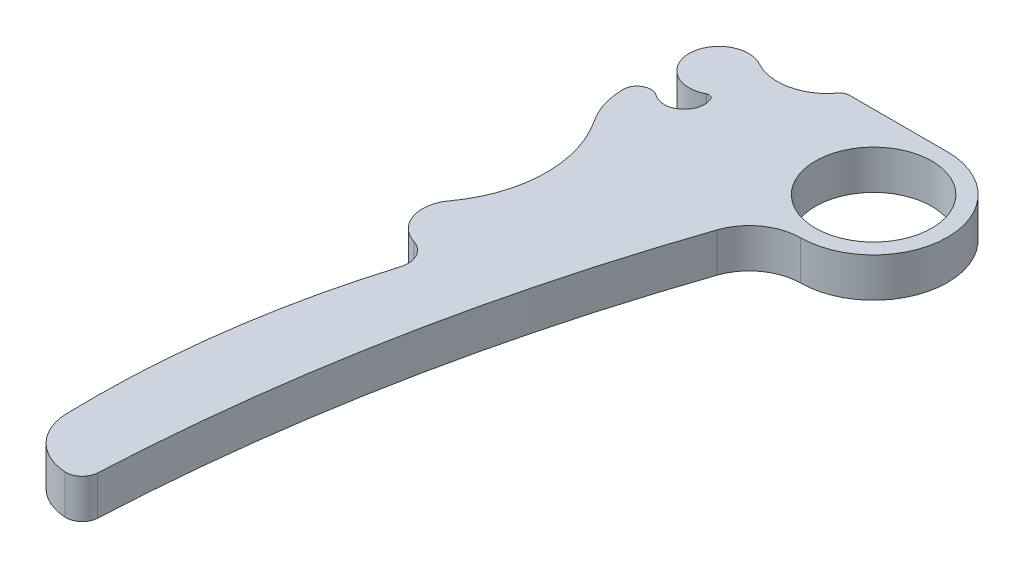
ISO-10303-21;
HEADER;
FILE_DESCRIPTION(('STEP AP214'),'2;1');
FILE_NAME('part.step','',(''),(''),'','','');
FILE_SCHEMA(('AUTOMOTIVE_DESIGN { 1 0 10303 214 1 1 1 1 }'));
ENDSEC;
DATA;
#1=APPLICATION_CONTEXT('core data for automotive mechanical design processes');
#2=APPLICATION_PROTOCOL_DEFINITION('international standard','automotive_design',2000,#1);
#3=PRODUCT_CONTEXT('',#1,'mechanical');
#4=PRODUCT('Part','Part','',(#3));
#5=PRODUCT_RELATED_PRODUCT_CATEGORY('part','',(#4));
#6=PRODUCT_DEFINITION_FORMATION('','',#4);
#7=PRODUCT_DEFINITION_CONTEXT('part definition',#1,'design');
#8=PRODUCT_DEFINITION('design','',#6,#7);
#9=PRODUCT_DEFINITION_SHAPE('','',#8);
#10=(LENGTH_UNIT() NAMED_UNIT(*) SI_UNIT(.MILLI.,.METRE.));
#11=(NAMED_UNIT(*) PLANE_ANGLE_UNIT() SI_UNIT($,.RADIAN.));
#12=(NAMED_UNIT(*) SI_UNIT($,.STERADIAN.) SOLID_ANGLE_UNIT());
#13=UNCERTAINTY_MEASURE_WITH_UNIT(LENGTH_MEASURE(1.E-05),#10,'distance_accuracy_value','');
#14=(GEOMETRIC_REPRESENTATION_CONTEXT(3) GLOBAL_UNCERTAINTY_ASSIGNED_CONTEXT((#13)) GLOBAL_UNIT_ASSIGNED_CONTEXT((#10,
#11,#12)) REPRESENTATION_CONTEXT('',''));
#15=CARTESIAN_POINT('',(0.,0.,0.));
#16=DIRECTION('',(0.,0.,1.));
#17=DIRECTION('',(1.,0.,0.));
#18=AXIS2_PLACEMENT_3D('',#15,#16,#17);
#19=CARTESIAN_POINT('',(-12.8860351239819,3.,0.0601391589932283));
#20=DIRECTION('',(0.,-1.,0.));
#21=DIRECTION('',(0.,0.,-1.));
#22=AXIS2_PLACEMENT_3D('',#19,#20,#21);
#23=CYLINDRICAL_SURFACE('',#22,0.373802251179786);
#24=CARTESIAN_POINT('',(-12.8860351239819,0.,0.0601391589932283));
#25=DIRECTION('',(0.,1.,0.));
#26=DIRECTION('',(0.,0.,1.));
#27=AXIS2_PLACEMENT_3D('',#24,#25,#26);
#28=CIRCLE('',#27,0.373802251179786);
#29=CARTESIAN_POINT('',(-12.539738196853,0.,-0.0805966262504437));
#30=VERTEX_POINT('',#29);
#31=CARTESIAN_POINT('',(-13.0589268030003,0.,-0.271276879111866));
#32=VERTEX_POINT('',#31);
#33=EDGE_CURVE('E186',#30,#32,#28,.T.);
#34=ORIENTED_EDGE('',*,*,#33,.F.);
#35=DIRECTION('',(0.,-1.,0.));
#36=VECTOR('',#35,1.);
#37=CARTESIAN_POINT('',(-12.539738196853,3.,-0.0805966262504437));
#38=LINE('',#37,#36);
#39=CARTESIAN_POINT('',(-12.539738196853,3.,-0.0805966262504437));
#40=VERTEX_POINT('',#39);
#41=EDGE_CURVE('E11',#40,#30,#38,.T.);
#42=ORIENTED_EDGE('',*,*,#41,.F.);
#43=CARTESIAN_POINT('',(-12.8860351239819,3.,0.0601391589932283));
#44=DIRECTION('',(0.,1.,0.));
#45=DIRECTION('',(0.,0.,1.));
#46=AXIS2_PLACEMENT_3D('',#43,#44,#45);
#47=CIRCLE('',#46,0.373802251179786);
#48=CARTESIAN_POINT('',(-13.0589268030003,3.,-0.271276879111866));
#49=VERTEX_POINT('',#48);
#50=EDGE_CURVE('E231',#40,#49,#47,.T.);
#51=ORIENTED_EDGE('',*,*,#50,.T.);
#52=DIRECTION('',(0.,-1.,0.));
#53=VECTOR('',#52,1.);
#54=CARTESIAN_POINT('',(-13.0589268030003,3.,-0.271276879111866));
#55=LINE('',#54,#53);
#56=EDGE_CURVE('E112',#49,#32,#55,.T.);
#57=ORIENTED_EDGE('',*,*,#56,.T.);
#58=EDGE_LOOP('',(#34,#42,#51,#57));
#59=FACE_BOUND('',#58,.T.);
#60=ADVANCED_FACE('F35',(#59),#23,.F.);
#61=CARTESIAN_POINT('',(-13.9659429335537,3.,0.499015919555077));
#62=DIRECTION('',(0.,-1.,0.));
#63=DIRECTION('',(0.,0.,-1.));
#64=AXIS2_PLACEMENT_3D('',#61,#62,#63);
#65=CYLINDRICAL_SURFACE('',#64,1.5394838921673);
#66=CARTESIAN_POINT('',(-13.9659429335537,0.,0.499015919555077));
#67=DIRECTION('',(0.,1.,0.));
#68=DIRECTION('',(0.,0.,1.));
#69=AXIS2_PLACEMENT_3D('',#66,#67,#68);
#70=CIRCLE('',#69,1.5394838921673);
#71=CARTESIAN_POINT('',(-14.8662965357061,0.,1.74776491168031));
#72=VERTEX_POINT('',#71);
#73=EDGE_CURVE('E189',#72,#30,#70,.T.);
#74=ORIENTED_EDGE('',*,*,#73,.F.);
#75=DIRECTION('',(0.,-1.,0.));
#76=VECTOR('',#75,1.);
#77=CARTESIAN_POINT('',(-14.8662965357061,3.,1.74776491168031));
#78=LINE('',#77,#76);
#79=CARTESIAN_POINT('',(-14.8662965357061,3.,1.74776491168031));
#80=VERTEX_POINT('',#79);
#81=EDGE_CURVE('E43',#80,#72,#78,.T.);
#82=ORIENTED_EDGE('',*,*,#81,.F.);
#83=CARTESIAN_POINT('',(-13.9659429335537,3.,0.499015919555077));
#84=DIRECTION('',(0.,1.,0.));
#85=DIRECTION('',(0.,0.,1.));
#86=AXIS2_PLACEMENT_3D('',#83,#84,#85);
#87=CIRCLE('',#86,1.5394838921673);
#88=EDGE_CURVE('E275',#80,#40,#87,.T.);
#89=ORIENTED_EDGE('',*,*,#88,.T.);
#90=ORIENTED_EDGE('',*,*,#41,.T.);
#91=EDGE_LOOP('',(#74,#82,#89,#90));
#92=FACE_BOUND('',#91,.T.);
#93=ADVANCED_FACE('F274',(#92),#65,.F.);
#94=CARTESIAN_POINT('',(-15.4786831947654,3.,2.59711701230295));
#95=DIRECTION('',(0.,-1.,0.));
#96=DIRECTION('',(0.,0.,-1.));
#97=AXIS2_PLACEMENT_3D('',#94,#95,#96);
#98=CYLINDRICAL_SURFACE('',#97,1.04709904547085);
#99=CARTESIAN_POINT('',(-15.4786831947654,0.,2.59711701230295));
#100=DIRECTION('',(0.,1.,0.));
#101=DIRECTION('',(0.,0.,1.));
#102=AXIS2_PLACEMENT_3D('',#99,#100,#101);
#103=CIRCLE('',#102,1.04709904547085);
#104=CARTESIAN_POINT('',(-16.5257822402363,0.,2.59711701241037));
#105=VERTEX_POINT('',#104);
#106=EDGE_CURVE('E192',#72,#105,#103,.T.);
#107=ORIENTED_EDGE('',*,*,#106,.T.);
#108=DIRECTION('',(0.,-1.,0.));
#109=VECTOR('',#108,1.);
#110=CARTESIAN_POINT('',(-16.5257822402363,3.,2.59711701241037));
#111=LINE('',#110,#109);
#112=CARTESIAN_POINT('',(-16.5257822402363,3.,2.59711701241037));
#113=VERTEX_POINT('',#112);
#114=EDGE_CURVE('E258',#113,#105,#111,.T.);
#115=ORIENTED_EDGE('',*,*,#114,.F.);
#116=CARTESIAN_POINT('',(-15.4786831947654,3.,2.59711701230295));
#117=DIRECTION('',(0.,1.,0.));
#118=DIRECTION('',(0.,0.,1.));
#119=AXIS2_PLACEMENT_3D('',#116,#117,#118);
#120=CIRCLE('',#119,1.04709904547085);
#121=EDGE_CURVE('E265',#80,#113,#120,.T.);
#122=ORIENTED_EDGE('',*,*,#121,.F.);
#123=ORIENTED_EDGE('',*,*,#81,.T.);
#124=EDGE_LOOP('',(#107,#115,#122,#123));
#125=FACE_BOUND('',#124,.T.);
#126=ADVANCED_FACE('F263',(#125),#98,.T.);
#127=CARTESIAN_POINT('',(-10.824602046063,3.,2.59711701182551));
#128=DIRECTION('',(0.,-1.,0.));
#129=DIRECTION('',(0.,0.,-1.));
#130=AXIS2_PLACEMENT_3D('',#127,#128,#129);
#131=CYLINDRICAL_SURFACE('',#130,5.70118019417329);
#132=CARTESIAN_POINT('',(-10.824602046063,0.,2.59711701182551));
#133=DIRECTION('',(0.,1.,0.));
#134=DIRECTION('',(0.,0.,1.));
#135=AXIS2_PLACEMENT_3D('',#132,#133,#134);
#136=CIRCLE('',#135,5.70118019417329);
#137=CARTESIAN_POINT('',(-15.5614214832654,0.,5.76981258905556));
#138=VERTEX_POINT('',#137);
#139=EDGE_CURVE('E194',#105,#138,#136,.T.);
#140=ORIENTED_EDGE('',*,*,#139,.T.);
#141=DIRECTION('',(0.,-1.,0.));
#142=VECTOR('',#141,1.);
#143=CARTESIAN_POINT('',(-15.5614214832654,3.,5.76981258905556));
#144=LINE('',#143,#142);
#145=CARTESIAN_POINT('',(-15.5614214832654,3.,5.76981258905556));
#146=VERTEX_POINT('',#145);
#147=EDGE_CURVE('E256',#146,#138,#144,.T.);
#148=ORIENTED_EDGE('',*,*,#147,.F.);
#149=CARTESIAN_POINT('',(-10.824602046063,3.,2.59711701182551));
#150=DIRECTION('',(0.,1.,0.));
#151=DIRECTION('',(0.,0.,1.));
#152=AXIS2_PLACEMENT_3D('',#149,#150,#151);
#153=CIRCLE('',#152,5.70118019417329);
#154=EDGE_CURVE('E281',#113,#146,#153,.T.);
#155=ORIENTED_EDGE('',*,*,#154,.F.);
#156=ORIENTED_EDGE('',*,*,#114,.T.);
#157=EDGE_LOOP('',(#140,#148,#155,#156));
#158=FACE_BOUND('',#157,.T.);
#159=ADVANCED_FACE('F351',(#158),#131,.T.);
#160=CARTESIAN_POINT('',(-23.4182364641216,3.,11.0322640021496));
#161=DIRECTION('',(0.,-1.,0.));
#162=DIRECTION('',(0.,0.,-1.));
#163=AXIS2_PLACEMENT_3D('',#160,#161,#162);
#164=CYLINDRICAL_SURFACE('',#163,9.45637015553975);
#165=CARTESIAN_POINT('',(-23.4182364641216,0.,11.0322640021496));
#166=DIRECTION('',(0.,1.,0.));
#167=DIRECTION('',(0.,0.,1.));
#168=AXIS2_PLACEMENT_3D('',#165,#166,#167);
#169=CIRCLE('',#168,9.45637015553975);
#170=CARTESIAN_POINT('',(-15.7950455479493,0.,16.627788711609));
#171=VERTEX_POINT('',#170);
#172=EDGE_CURVE('E197',#171,#138,#169,.T.);
#173=ORIENTED_EDGE('',*,*,#172,.F.);
#174=DIRECTION('',(0.,-1.,0.));
#175=VECTOR('',#174,1.);
#176=CARTESIAN_POINT('',(-15.7950455479493,3.,16.627788711609));
#177=LINE('',#176,#175);
#178=CARTESIAN_POINT('',(-15.7950455479493,3.,16.627788711609));
#179=VERTEX_POINT('',#178);
#180=EDGE_CURVE('E254',#179,#171,#177,.T.);
#181=ORIENTED_EDGE('',*,*,#180,.F.);
#182=CARTESIAN_POINT('',(-23.4182364641216,3.,11.0322640021496));
#183=DIRECTION('',(0.,1.,0.));
#184=DIRECTION('',(0.,0.,1.));
#185=AXIS2_PLACEMENT_3D('',#182,#183,#184);
#186=CIRCLE('',#185,9.45637015553975);
#187=EDGE_CURVE('E283',#179,#146,#186,.T.);
#188=ORIENTED_EDGE('',*,*,#187,.T.);
#189=ORIENTED_EDGE('',*,*,#147,.T.);
#190=EDGE_LOOP('',(#173,#181,#188,#189));
#191=FACE_BOUND('',#190,.T.);
#192=ADVANCED_FACE('F346',(#191),#164,.F.);
#193=CARTESIAN_POINT('',(-13.6910966752362,3.,18.172115494732));
#194=DIRECTION('',(0.,-1.,0.));
#195=DIRECTION('',(0.,0.,-1.));
#196=AXIS2_PLACEMENT_3D('',#193,#194,#195);
#197=CYLINDRICAL_SURFACE('',#196,2.6098938813794);
#198=CARTESIAN_POINT('',(-13.6910966752362,0.,18.172115494732));
#199=DIRECTION('',(0.,1.,0.));
#200=DIRECTION('',(0.,0.,1.));
#201=AXIS2_PLACEMENT_3D('',#198,#199,#200);
#202=CIRCLE('',#201,2.6098938813794);
#203=CARTESIAN_POINT('',(-14.4674142758295,0.,20.663877332282));
#204=VERTEX_POINT('',#203);
#205=EDGE_CURVE('E200',#171,#204,#202,.T.);
#206=ORIENTED_EDGE('',*,*,#205,.T.);
#207=DIRECTION('',(0.,-1.,0.));
#208=VECTOR('',#207,1.);
#209=CARTESIAN_POINT('',(-14.4674142758295,3.,20.663877332282));
#210=LINE('',#209,#208);
#211=CARTESIAN_POINT('',(-14.4674142758295,3.,20.663877332282));
#212=VERTEX_POINT('',#211);
#213=EDGE_CURVE('E252',#212,#204,#210,.T.);
#214=ORIENTED_EDGE('',*,*,#213,.F.);
#215=CARTESIAN_POINT('',(-13.6910966752362,3.,18.172115494732));
#216=DIRECTION('',(0.,1.,0.));
#217=DIRECTION('',(0.,0.,1.));
#218=AXIS2_PLACEMENT_3D('',#215,#216,#217);
#219=CIRCLE('',#218,2.6098938813794);
#220=EDGE_CURVE('E286',#179,#212,#219,.T.);
#221=ORIENTED_EDGE('',*,*,#220,.F.);
#222=ORIENTED_EDGE('',*,*,#180,.T.);
#223=EDGE_LOOP('',(#206,#214,#221,#222));
#224=FACE_BOUND('',#223,.T.);
#225=ADVANCED_FACE('F343',(#224),#197,.T.);
#226=CARTESIAN_POINT('',(-14.9919428263231,3.,22.3474669144668));
#227=DIRECTION('',(0.,-1.,0.));
#228=DIRECTION('',(0.,0.,-1.));
#229=AXIS2_PLACEMENT_3D('',#226,#227,#228);
#230=CYLINDRICAL_SURFACE('',#229,1.76340695289664);
#231=CARTESIAN_POINT('',(-14.9919428263231,0.,22.3474669144668));
#232=DIRECTION('',(0.,1.,0.));
#233=DIRECTION('',(0.,0.,1.));
#234=AXIS2_PLACEMENT_3D('',#231,#232,#233);
#235=CIRCLE('',#234,1.76340695289664);
#236=CARTESIAN_POINT('',(-13.3047562070204,0.,22.8603074288278));
#237=VERTEX_POINT('',#236);
#238=EDGE_CURVE('E203',#237,#204,#235,.T.);
#239=ORIENTED_EDGE('',*,*,#238,.F.);
#240=DIRECTION('',(0.,-1.,0.));
#241=VECTOR('',#240,1.);
#242=CARTESIAN_POINT('',(-13.3047562070204,3.,22.8603074288278));
#243=LINE('',#242,#241);
#244=CARTESIAN_POINT('',(-13.3047562070204,3.,22.8603074288278));
#245=VERTEX_POINT('',#244);
#246=EDGE_CURVE('E250',#245,#237,#243,.T.);
#247=ORIENTED_EDGE('',*,*,#246,.F.);
#248=CARTESIAN_POINT('',(-14.9919428263231,3.,22.3474669144668));
#249=DIRECTION('',(0.,1.,0.));
#250=DIRECTION('',(0.,0.,1.));
#251=AXIS2_PLACEMENT_3D('',#248,#249,#250);
#252=CIRCLE('',#251,1.76340695289664);
#253=EDGE_CURVE('E288',#245,#212,#252,.T.);
#254=ORIENTED_EDGE('',*,*,#253,.T.);
#255=ORIENTED_EDGE('',*,*,#213,.T.);
#256=EDGE_LOOP('',(#239,#247,#254,#255));
#257=FACE_BOUND('',#256,.T.);
#258=ADVANCED_FACE('F339',(#257),#230,.F.);
#259=CARTESIAN_POINT('',(54.3547115224031,3.,43.4262103554928));
#260=DIRECTION('',(0.,-1.,0.));
#261=DIRECTION('',(0.,0.,-1.));
#262=AXIS2_PLACEMENT_3D('',#259,#260,#261);
#263=CYLINDRICAL_SURFACE('',#262,70.7160514778498);
#264=CARTESIAN_POINT('',(54.3547115224031,0.,43.4262103554928));
#265=DIRECTION('',(0.,1.,0.));
#266=DIRECTION('',(0.,0.,1.));
#267=AXIS2_PLACEMENT_3D('',#264,#265,#266);
#268=CIRCLE('',#267,70.7160514778498);
#269=CARTESIAN_POINT('',(-16.3350242879023,0.,45.3552483766642));
#270=VERTEX_POINT('',#269);
#271=EDGE_CURVE('E206',#237,#270,#268,.T.);
#272=ORIENTED_EDGE('',*,*,#271,.T.);
#273=DIRECTION('',(0.,-1.,0.));
#274=VECTOR('',#273,1.);
#275=CARTESIAN_POINT('',(-16.3350242879023,3.,45.3552483766642));
#276=LINE('',#275,#274);
#277=CARTESIAN_POINT('',(-16.3350242879023,3.,45.3552483766642));
#278=VERTEX_POINT('',#277);
#279=EDGE_CURVE('E247',#278,#270,#276,.T.);
#280=ORIENTED_EDGE('',*,*,#279,.F.);
#281=CARTESIAN_POINT('',(54.3547115224031,3.,43.4262103554928));
#282=DIRECTION('',(0.,1.,0.));
#283=DIRECTION('',(0.,0.,1.));
#284=AXIS2_PLACEMENT_3D('',#281,#282,#283);
#285=CIRCLE('',#284,70.7160514778498);
#286=EDGE_CURVE('E291',#245,#278,#285,.T.);
#287=ORIENTED_EDGE('',*,*,#286,.F.);
#288=ORIENTED_EDGE('',*,*,#246,.T.);
#289=EDGE_LOOP('',(#272,#280,#287,#288));
#290=FACE_BOUND('',#289,.T.);
#291=ADVANCED_FACE('F334',(#290),#263,.T.);
#292=CARTESIAN_POINT('',(-12.336512813385,3.,45.2461337990807));
#293=DIRECTION('',(0.,-1.,0.));
#294=DIRECTION('',(0.,0.,-1.));
#295=AXIS2_PLACEMENT_3D('',#292,#293,#294);
#296=CYLINDRICAL_SURFACE('',#295,4.00000000036101);
#297=CARTESIAN_POINT('',(-12.336512813385,0.,45.2461337990807));
#298=DIRECTION('',(0.,1.,0.));
#299=DIRECTION('',(0.,0.,1.));
#300=AXIS2_PLACEMENT_3D('',#297,#298,#299);
#301=CIRCLE('',#300,4.00000000036101);
#302=CARTESIAN_POINT('',(-12.5314030357484,0.,49.2413832035754));
#303=VERTEX_POINT('',#302);
#304=EDGE_CURVE('E208',#270,#303,#301,.T.);
#305=ORIENTED_EDGE('',*,*,#304,.T.);
#306=DIRECTION('',(0.,-1.,0.));
#307=VECTOR('',#306,1.);
#308=CARTESIAN_POINT('',(-12.5314030357484,3.,49.2413832035754));
#309=LINE('',#308,#307);
#310=CARTESIAN_POINT('',(-12.5314030357484,3.,49.2413832035754));
#311=VERTEX_POINT('',#310);
#312=EDGE_CURVE('E244',#311,#303,#309,.T.);
#313=ORIENTED_EDGE('',*,*,#312,.F.);
#314=CARTESIAN_POINT('',(-12.336512813385,3.,45.2461337990807));
#315=DIRECTION('',(0.,1.,0.));
#316=DIRECTION('',(0.,0.,1.));
#317=AXIS2_PLACEMENT_3D('',#314,#315,#316);
#318=CIRCLE('',#317,4.00000000036101);
#319=EDGE_CURVE('E293',#278,#311,#318,.T.);
#320=ORIENTED_EDGE('',*,*,#319,.F.);
#321=ORIENTED_EDGE('',*,*,#279,.T.);
#322=EDGE_LOOP('',(#305,#313,#320,#321));
#323=FACE_BOUND('',#322,.T.);
#324=ADVANCED_FACE('F330',(#323),#296,.T.);
#325=CARTESIAN_POINT('',(-12.4708211198052,3.,47.9994539745962));
#326=DIRECTION('',(0.,-1.,0.));
#327=DIRECTION('',(0.,0.,-1.));
#328=AXIS2_PLACEMENT_3D('',#325,#326,#327);
#329=CYLINDRICAL_SURFACE('',#328,1.24340595878102);
#330=CARTESIAN_POINT('',(-12.4708211198052,0.,47.9994539745962));
#331=DIRECTION('',(0.,1.,0.));
#332=DIRECTION('',(0.,0.,1.));
#333=AXIS2_PLACEMENT_3D('',#330,#331,#332);
#334=CIRCLE('',#333,1.24340595878102);
#335=CARTESIAN_POINT('',(-11.2289049844811,0.,48.0603037170265));
#336=VERTEX_POINT('',#335);
#337=EDGE_CURVE('E210',#303,#336,#334,.T.);
#338=ORIENTED_EDGE('',*,*,#337,.T.);
#339=DIRECTION('',(0.,-1.,0.));
#340=VECTOR('',#339,1.);
#341=CARTESIAN_POINT('',(-11.2289049844811,3.,48.0603037170265));
#342=LINE('',#341,#340);
#343=CARTESIAN_POINT('',(-11.2289049844811,3.,48.0603037170265));
#344=VERTEX_POINT('',#343);
#345=EDGE_CURVE('E242',#344,#336,#342,.T.);
#346=ORIENTED_EDGE('',*,*,#345,.F.);
#347=CARTESIAN_POINT('',(-12.4708211198052,3.,47.9994539745962));
#348=DIRECTION('',(0.,1.,0.));
#349=DIRECTION('',(0.,0.,1.));
#350=AXIS2_PLACEMENT_3D('',#347,#348,#349);
#351=CIRCLE('',#350,1.24340595878102);
#352=EDGE_CURVE('E295',#311,#344,#351,.T.);
#353=ORIENTED_EDGE('',*,*,#352,.F.);
#354=ORIENTED_EDGE('',*,*,#312,.T.);
#355=EDGE_LOOP('',(#338,#346,#353,#354));
#356=FACE_BOUND('',#355,.T.);
#357=ADVANCED_FACE('F325',(#356),#329,.T.);
#358=CARTESIAN_POINT('',(133.907206749014,3.,55.1620284760905));
#359=DIRECTION('',(0.,-1.,0.));
#360=DIRECTION('',(0.,0.,-1.));
#361=AXIS2_PLACEMENT_3D('',#358,#359,#360);
#362=CYLINDRICAL_SURFACE('',#361,145.309756808244);
#363=CARTESIAN_POINT('',(133.907206749014,0.,55.1620284760905));
#364=DIRECTION('',(0.,1.,0.));
#365=DIRECTION('',(0.,0.,1.));
#366=AXIS2_PLACEMENT_3D('',#363,#364,#365);
#367=CIRCLE('',#366,145.309756808244);
#368=CARTESIAN_POINT('',(-3.64283322272102,0.,8.31214131032274));
#369=VERTEX_POINT('',#368);
#370=EDGE_CURVE('E213',#369,#336,#367,.T.);
#371=ORIENTED_EDGE('',*,*,#370,.F.);
#372=DIRECTION('',(0.,-1.,0.));
#373=VECTOR('',#372,1.);
#374=CARTESIAN_POINT('',(-3.64283322272102,3.,8.31214131032274));
#375=LINE('',#374,#373);
#376=CARTESIAN_POINT('',(-3.64283322272102,3.,8.31214131032274));
#377=VERTEX_POINT('',#376);
#378=EDGE_CURVE('E240',#377,#369,#375,.T.);
#379=ORIENTED_EDGE('',*,*,#378,.F.);
#380=CARTESIAN_POINT('',(133.907206749014,3.,55.1620284760905));
#381=DIRECTION('',(0.,1.,0.));
#382=DIRECTION('',(0.,0.,1.));
#383=AXIS2_PLACEMENT_3D('',#380,#381,#382);
#384=CIRCLE('',#383,145.309756808244);
#385=EDGE_CURVE('E297',#377,#344,#384,.T.);
#386=ORIENTED_EDGE('',*,*,#385,.T.);
#387=ORIENTED_EDGE('',*,*,#345,.T.);
#388=EDGE_LOOP('',(#371,#379,#386,#387));
#389=FACE_BOUND('',#388,.T.);
#390=ADVANCED_FACE('F319',(#389),#362,.F.);
#391=CARTESIAN_POINT('',(0.0784182429327268,3.,9.58220274756172));
#392=DIRECTION('',(0.,-1.,0.));
#393=DIRECTION('',(0.,0.,-1.));
#394=AXIS2_PLACEMENT_3D('',#391,#392,#393);
#395=CYLINDRICAL_SURFACE('',#394,3.93201837800788);
#396=CARTESIAN_POINT('',(0.0784182429327268,0.,9.58220274756172));
#397=DIRECTION('',(0.,1.,0.));
#398=DIRECTION('',(0.,0.,1.));
#399=AXIS2_PLACEMENT_3D('',#396,#397,#398);
#400=CIRCLE('',#399,3.93201837800788);
#401=CARTESIAN_POINT('',(0.0462407096826565,0.,5.65031603361057));
#402=VERTEX_POINT('',#401);
#403=EDGE_CURVE('E216',#402,#369,#400,.T.);
#404=ORIENTED_EDGE('',*,*,#403,.F.);
#405=DIRECTION('',(0.,-1.,0.));
#406=VECTOR('',#405,1.);
#407=CARTESIAN_POINT('',(0.0462407096826565,3.,5.65031603361057));
#408=LINE('',#407,#406);
#409=CARTESIAN_POINT('',(0.0462407096826565,3.,5.65031603361057));
#410=VERTEX_POINT('',#409);
#411=EDGE_CURVE('E238',#410,#402,#408,.T.);
#412=ORIENTED_EDGE('',*,*,#411,.F.);
#413=CARTESIAN_POINT('',(0.0784182429327268,3.,9.58220274756172));
#414=DIRECTION('',(0.,1.,0.));
#415=DIRECTION('',(0.,0.,1.));
#416=AXIS2_PLACEMENT_3D('',#413,#414,#415);
#417=CIRCLE('',#416,3.93201837800788);
#418=EDGE_CURVE('E300',#410,#377,#417,.T.);
#419=ORIENTED_EDGE('',*,*,#418,.T.);
#420=ORIENTED_EDGE('',*,*,#378,.T.);
#421=EDGE_LOOP('',(#404,#412,#419,#420));
#422=FACE_BOUND('',#421,.T.);
#423=ADVANCED_FACE('F316',(#422),#395,.F.);
#424=CARTESIAN_POINT('',(0.,3.,0.));
#425=DIRECTION('',(0.,-1.,0.));
#426=DIRECTION('',(0.,0.,-1.));
#427=AXIS2_PLACEMENT_3D('',#424,#425,#426);
#428=CYLINDRICAL_SURFACE('',#427,5.65050524138405);
#429=CARTESIAN_POINT('',(0.,0.,0.));
#430=DIRECTION('',(0.,1.,0.));
#431=DIRECTION('',(0.,0.,1.));
#432=AXIS2_PLACEMENT_3D('',#429,#430,#431);
#433=CIRCLE('',#432,5.65050524138405);
#434=CARTESIAN_POINT('',(0.,0.,-5.65050524138405));
#435=VERTEX_POINT('',#434);
#436=EDGE_CURVE('E219',#402,#435,#433,.T.);
#437=ORIENTED_EDGE('',*,*,#436,.T.);
#438=DIRECTION('',(0.,-1.,0.));
#439=VECTOR('',#438,1.);
#440=CARTESIAN_POINT('',(0.,3.,-5.65050524138405));
#441=LINE('',#440,#439);
#442=CARTESIAN_POINT('',(0.,3.,-5.65050524138405));
#443=VERTEX_POINT('',#442);
#444=EDGE_CURVE('E235',#443,#435,#441,.T.);
#445=ORIENTED_EDGE('',*,*,#444,.F.);
#446=CARTESIAN_POINT('',(0.,3.,0.));
#447=DIRECTION('',(0.,1.,0.));
#448=DIRECTION('',(0.,0.,1.));
#449=AXIS2_PLACEMENT_3D('',#446,#447,#448);
#450=CIRCLE('',#449,5.65050524138405);
#451=EDGE_CURVE('E303',#410,#443,#450,.T.);
#452=ORIENTED_EDGE('',*,*,#451,.F.);
#453=ORIENTED_EDGE('',*,*,#411,.T.);
#454=EDGE_LOOP('',(#437,#445,#452,#453));
#455=FACE_BOUND('',#454,.T.);
#456=ADVANCED_FACE('F309',(#455),#428,.T.);
#457=CARTESIAN_POINT('',(0.,3.,-5.65050524138405));
#458=DIRECTION('',(0.,0.,1.));
#459=DIRECTION('',(1.,0.,0.));
#460=AXIS2_PLACEMENT_3D('',#457,#458,#459);
#461=PLANE('',#460);
#462=DIRECTION('',(-1.,0.,0.));
#463=VECTOR('',#462,1.);
#464=CARTESIAN_POINT('',(0.,0.,-5.65050524138405));
#465=LINE('',#464,#463);
#466=CARTESIAN_POINT('',(-7.48820189311142,0.,-5.65050524138405));
#467=VERTEX_POINT('',#466);
#468=EDGE_CURVE('E221',#435,#467,#465,.T.);
#469=ORIENTED_EDGE('',*,*,#468,.T.);
#470=DIRECTION('',(0.,-1.,0.));
#471=VECTOR('',#470,1.);
#472=CARTESIAN_POINT('',(-7.48820189311142,3.,-5.65050524138405));
#473=LINE('',#472,#471);
#474=CARTESIAN_POINT('',(-7.48820189311142,3.,-5.65050524138405));
#475=VERTEX_POINT('',#474);
#476=EDGE_CURVE('E176',#475,#467,#473,.T.);
#477=ORIENTED_EDGE('',*,*,#476,.F.);
#478=DIRECTION('',(-1.,0.,0.));
#479=VECTOR('',#478,1.);
#480=CARTESIAN_POINT('',(0.,3.,-5.65050524138405));
#481=LINE('',#480,#479);
#482=EDGE_CURVE('E163',#443,#475,#481,.T.);
#483=ORIENTED_EDGE('',*,*,#482,.F.);
#484=ORIENTED_EDGE('',*,*,#444,.T.);
#485=EDGE_LOOP('',(#469,#477,#483,#484));
#486=FACE_BOUND('',#485,.T.);
#487=ADVANCED_FACE('F313',(#486),#461,.F.);
#488=CARTESIAN_POINT('',(-7.48820189311142,3.,-4.90645221536587));
#489=DIRECTION('',(0.,-1.,0.));
#490=DIRECTION('',(0.,0.,-1.));
#491=AXIS2_PLACEMENT_3D('',#488,#489,#490);
#492=CYLINDRICAL_SURFACE('',#491,0.744053026018181);
#493=CARTESIAN_POINT('',(-7.48820189311142,0.,-4.90645221536587));
#494=DIRECTION('',(0.,1.,0.));
#495=DIRECTION('',(0.,0.,1.));
#496=AXIS2_PLACEMENT_3D('',#493,#494,#495);
#497=CIRCLE('',#496,0.744053026018181);
#498=CARTESIAN_POINT('',(-8.08677628271404,0.,-5.34840651802471));
#499=VERTEX_POINT('',#498);
#500=EDGE_CURVE('E172',#467,#499,#497,.T.);
#501=ORIENTED_EDGE('',*,*,#500,.T.);
#502=DIRECTION('',(0.,-1.,0.));
#503=VECTOR('',#502,1.);
#504=CARTESIAN_POINT('',(-8.08677628271404,3.,-5.34840651802471));
#505=LINE('',#504,#503);
#506=CARTESIAN_POINT('',(-8.08677628271404,3.,-5.34840651802471));
#507=VERTEX_POINT('',#506);
#508=EDGE_CURVE('E169',#507,#499,#505,.T.);
#509=ORIENTED_EDGE('',*,*,#508,.F.);
#510=CARTESIAN_POINT('',(-7.48820189311142,3.,-4.90645221536587));
#511=DIRECTION('',(0.,1.,0.));
#512=DIRECTION('',(0.,0.,1.));
#513=AXIS2_PLACEMENT_3D('',#510,#511,#512);
#514=CIRCLE('',#513,0.744053026018181);
#515=EDGE_CURVE('E156',#475,#507,#514,.T.);
#516=ORIENTED_EDGE('',*,*,#515,.F.);
#517=ORIENTED_EDGE('',*,*,#476,.T.);
#518=EDGE_LOOP('',(#501,#509,#516,#517));
#519=FACE_BOUND('',#518,.T.);
#520=ADVANCED_FACE('F170',(#519),#492,.T.);
#521=CARTESIAN_POINT('',(-11.1555981206665,3.,-7.6142552394792));
#522=DIRECTION('',(0.,-1.,0.));
#523=DIRECTION('',(0.,0.,-1.));
#524=AXIS2_PLACEMENT_3D('',#521,#522,#523);
#525=CYLINDRICAL_SURFACE('',#524,3.81467402298162);
#526=CARTESIAN_POINT('',(-11.1555981206665,0.,-7.6142552394792));
#527=DIRECTION('',(0.,1.,0.));
#528=DIRECTION('',(0.,0.,1.));
#529=AXIS2_PLACEMENT_3D('',#526,#527,#528);
#530=CIRCLE('',#529,3.81467402298162);
#531=CARTESIAN_POINT('',(-13.0070012791021,0.,-4.27898250002515));
#532=VERTEX_POINT('',#531);
#533=EDGE_CURVE('E224',#532,#499,#530,.T.);
#534=ORIENTED_EDGE('',*,*,#533,.F.);
#535=DIRECTION('',(0.,-1.,0.));
#536=VECTOR('',#535,1.);
#537=CARTESIAN_POINT('',(-13.0070012791021,3.,-4.27898250002515));
#538=LINE('',#537,#536);
#539=CARTESIAN_POINT('',(-13.0070012791021,3.,-4.27898250002515));
#540=VERTEX_POINT('',#539);
#541=EDGE_CURVE('E105',#540,#532,#538,.T.);
#542=ORIENTED_EDGE('',*,*,#541,.F.);
#543=CARTESIAN_POINT('',(-11.1555981206665,3.,-7.6142552394792));
#544=DIRECTION('',(0.,1.,0.));
#545=DIRECTION('',(0.,0.,1.));
#546=AXIS2_PLACEMENT_3D('',#543,#544,#545);
#547=CIRCLE('',#546,3.81467402298162);
#548=EDGE_CURVE('E161',#540,#507,#547,.T.);
#549=ORIENTED_EDGE('',*,*,#548,.T.);
#550=ORIENTED_EDGE('',*,*,#508,.T.);
#551=EDGE_LOOP('',(#534,#542,#549,#550));
#552=FACE_BOUND('',#551,.T.);
#553=ADVANCED_FACE('F178',(#552),#525,.F.);
#554=CARTESIAN_POINT('',(-14.1115784404071,3.,-2.28910467253092));
#555=DIRECTION('',(0.,-1.,0.));
#556=DIRECTION('',(0.,0.,-1.));
#557=AXIS2_PLACEMENT_3D('',#554,#555,#556);
#558=CYLINDRICAL_SURFACE('',#557,2.27589641100592);
#559=CARTESIAN_POINT('',(-14.1115784404071,0.,-2.28910467253092));
#560=DIRECTION('',(0.,1.,0.));
#561=DIRECTION('',(0.,0.,1.));
#562=AXIS2_PLACEMENT_3D('',#559,#560,#561);
#563=CIRCLE('',#562,2.27589641100592);
#564=EDGE_CURVE('E226',#532,#32,#563,.T.);
#565=ORIENTED_EDGE('',*,*,#564,.T.);
#566=ORIENTED_EDGE('',*,*,#56,.F.);
#567=CARTESIAN_POINT('',(-14.1115784404071,3.,-2.28910467253092));
#568=DIRECTION('',(0.,1.,0.));
#569=DIRECTION('',(0.,0.,1.));
#570=AXIS2_PLACEMENT_3D('',#567,#568,#569);
#571=CIRCLE('',#570,2.27589641100592);
#572=EDGE_CURVE('E51',#540,#49,#571,.T.);
#573=ORIENTED_EDGE('',*,*,#572,.F.);
#574=ORIENTED_EDGE('',*,*,#541,.T.);
#575=EDGE_LOOP('',(#565,#566,#573,#574));
#576=FACE_BOUND('',#575,.T.);
#577=ADVANCED_FACE('F276',(#576),#558,.T.);
#578=CARTESIAN_POINT('',(0.,3.,0.));
#579=DIRECTION('',(0.,-1.,0.));
#580=DIRECTION('',(0.,0.,-1.));
#581=AXIS2_PLACEMENT_3D('',#578,#579,#580);
#582=CYLINDRICAL_SURFACE('',#581,4.4467681909089);
#583=CARTESIAN_POINT('',(0.,3.,0.));
#584=DIRECTION('',(0.,1.,0.));
#585=DIRECTION('',(0.,0.,1.));
#586=AXIS2_PLACEMENT_3D('',#583,#584,#585);
#587=CIRCLE('',#586,4.4467681909089);
#588=CARTESIAN_POINT('',(0.,3.,4.4467681909089));
#589=VERTEX_POINT('',#588);
#590=EDGE_CURVE('E180',#589,#589,#587,.T.);
#591=ORIENTED_EDGE('',*,*,#590,.T.);
#592=EDGE_LOOP('',(#591));
#593=FACE_BOUND('',#592,.T.);
#594=CARTESIAN_POINT('',(0.,0.,0.));
#595=DIRECTION('',(0.,1.,0.));
#596=DIRECTION('',(0.,0.,1.));
#597=AXIS2_PLACEMENT_3D('',#594,#595,#596);
#598=CIRCLE('',#597,4.4467681909089);
#599=CARTESIAN_POINT('',(0.,0.,4.4467681909089));
#600=VERTEX_POINT('',#599);
#601=EDGE_CURVE('E228',#600,#600,#598,.T.);
#602=ORIENTED_EDGE('',*,*,#601,.F.);
#603=EDGE_LOOP('',(#602));
#604=FACE_BOUND('',#603,.T.);
#605=ADVANCED_FACE('F478',(#593,#604),#582,.F.);
#606=CARTESIAN_POINT('',(0.,3.,0.));
#607=DIRECTION('',(0.,1.,0.));
#608=DIRECTION('',(0.,0.,1.));
#609=AXIS2_PLACEMENT_3D('',#606,#607,#608);
#610=PLANE('',#609);
#611=ORIENTED_EDGE('',*,*,#50,.F.);
#612=ORIENTED_EDGE('',*,*,#88,.F.);
#613=ORIENTED_EDGE('',*,*,#121,.T.);
#614=ORIENTED_EDGE('',*,*,#154,.T.);
#615=ORIENTED_EDGE('',*,*,#187,.F.);
#616=ORIENTED_EDGE('',*,*,#220,.T.);
#617=ORIENTED_EDGE('',*,*,#253,.F.);
#618=ORIENTED_EDGE('',*,*,#286,.T.);
#619=ORIENTED_EDGE('',*,*,#319,.T.);
#620=ORIENTED_EDGE('',*,*,#352,.T.);
#621=ORIENTED_EDGE('',*,*,#385,.F.);
#622=ORIENTED_EDGE('',*,*,#418,.F.);
#623=ORIENTED_EDGE('',*,*,#451,.T.);
#624=ORIENTED_EDGE('',*,*,#482,.T.);
#625=ORIENTED_EDGE('',*,*,#515,.T.);
#626=ORIENTED_EDGE('',*,*,#548,.F.);
#627=ORIENTED_EDGE('',*,*,#572,.T.);
#628=EDGE_LOOP('',(#611,#612,#613,#614,#615,#616,#617,#618,#619,#620,#621,#622,#623,#624,#625,
#626,#627));
#629=FACE_BOUND('',#628,.T.);
#630=ORIENTED_EDGE('',*,*,#590,.F.);
#631=EDGE_LOOP('',(#630));
#632=FACE_BOUND('',#631,.T.);
#633=ADVANCED_FACE('F158',(#629,#632),#610,.T.);
#634=CARTESIAN_POINT('',(0.,0.,0.));
#635=DIRECTION('',(0.,1.,0.));
#636=DIRECTION('',(0.,0.,1.));
#637=AXIS2_PLACEMENT_3D('',#634,#635,#636);
#638=PLANE('',#637);
#639=ORIENTED_EDGE('',*,*,#33,.T.);
#640=ORIENTED_EDGE('',*,*,#564,.F.);
#641=ORIENTED_EDGE('',*,*,#533,.T.);
#642=ORIENTED_EDGE('',*,*,#500,.F.);
#643=ORIENTED_EDGE('',*,*,#468,.F.);
#644=ORIENTED_EDGE('',*,*,#436,.F.);
#645=ORIENTED_EDGE('',*,*,#403,.T.);
#646=ORIENTED_EDGE('',*,*,#370,.T.);
#647=ORIENTED_EDGE('',*,*,#337,.F.);
#648=ORIENTED_EDGE('',*,*,#304,.F.);
#649=ORIENTED_EDGE('',*,*,#271,.F.);
#650=ORIENTED_EDGE('',*,*,#238,.T.);
#651=ORIENTED_EDGE('',*,*,#205,.F.);
#652=ORIENTED_EDGE('',*,*,#172,.T.);
#653=ORIENTED_EDGE('',*,*,#139,.F.);
#654=ORIENTED_EDGE('',*,*,#106,.F.);
#655=ORIENTED_EDGE('',*,*,#73,.T.);
#656=EDGE_LOOP('',(#639,#640,#641,#642,#643,#644,#645,#646,#647,#648,#649,#650,#651,#652,#653,
#654,#655));
#657=FACE_BOUND('',#656,.T.);
#658=ORIENTED_EDGE('',*,*,#601,.T.);
#659=EDGE_LOOP('',(#658));
#660=FACE_BOUND('',#659,.T.);
#661=ADVANCED_FACE('F272',(#657,#660),#638,.F.);
#662=CLOSED_SHELL('',(#60,#93,#126,#159,#192,#225,#258,#291,#324,#357,#390,#423,#456,#487,#520,
#553,#577,#605,#633,#661));
#663=MANIFOLD_SOLID_BREP('B2',#662);
#664=ADVANCED_BREP_SHAPE_REPRESENTATION('',(#18,#663),#14);
#665=SHAPE_DEFINITION_REPRESENTATION(#9,#664);
ENDSEC;
END-ISO-10303-21;
